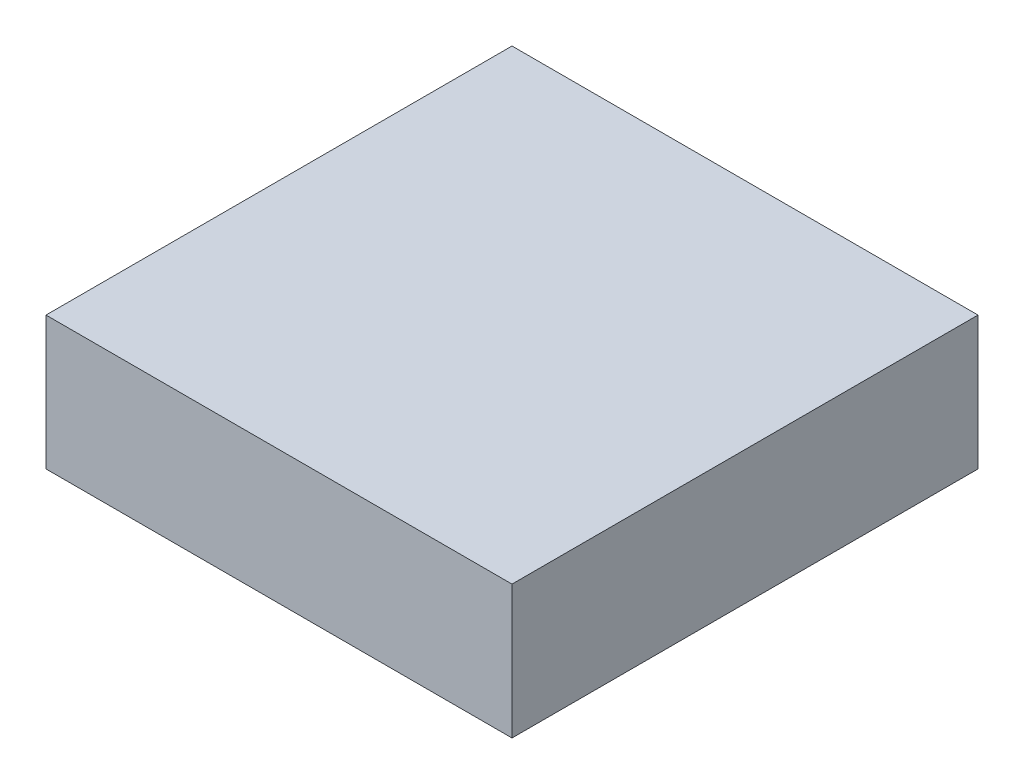
ISO-10303-21;
HEADER;
FILE_DESCRIPTION(('STEP AP214'),'2;1');
FILE_NAME('part.step','',(''),(''),'','','');
FILE_SCHEMA(('AUTOMOTIVE_DESIGN { 1 0 10303 214 1 1 1 1 }'));
ENDSEC;
DATA;
#1=APPLICATION_CONTEXT('core data for automotive mechanical design processes');
#2=APPLICATION_PROTOCOL_DEFINITION('international standard','automotive_design',2000,#1);
#3=PRODUCT_CONTEXT('',#1,'mechanical');
#4=PRODUCT('Part','Part','',(#3));
#5=PRODUCT_RELATED_PRODUCT_CATEGORY('part','',(#4));
#6=PRODUCT_DEFINITION_FORMATION('','',#4);
#7=PRODUCT_DEFINITION_CONTEXT('part definition',#1,'design');
#8=PRODUCT_DEFINITION('design','',#6,#7);
#9=PRODUCT_DEFINITION_SHAPE('','',#8);
#10=(LENGTH_UNIT() NAMED_UNIT(*) SI_UNIT(.MILLI.,.METRE.));
#11=(NAMED_UNIT(*) PLANE_ANGLE_UNIT() SI_UNIT($,.RADIAN.));
#12=(NAMED_UNIT(*) SI_UNIT($,.STERADIAN.) SOLID_ANGLE_UNIT());
#13=UNCERTAINTY_MEASURE_WITH_UNIT(LENGTH_MEASURE(1.E-05),#10,'distance_accuracy_value','');
#14=(GEOMETRIC_REPRESENTATION_CONTEXT(3) GLOBAL_UNCERTAINTY_ASSIGNED_CONTEXT((#13)) GLOBAL_UNIT_ASSIGNED_CONTEXT((#10,
#11,#12)) REPRESENTATION_CONTEXT('',''));
#15=CARTESIAN_POINT('',(0.,0.,0.));
#16=DIRECTION('',(0.,0.,1.));
#17=DIRECTION('',(1.,0.,0.));
#18=AXIS2_PLACEMENT_3D('',#15,#16,#17);
#19=CARTESIAN_POINT('',(311.055684786296,105.589280016504,7.34009304640806));
#20=DIRECTION('',(0.,0.,-1.));
#21=DIRECTION('',(-1.,0.,0.));
#22=AXIS2_PLACEMENT_3D('',#19,#20,#21);
#23=PLANE('',#22);
#24=DIRECTION('',(1.,0.,0.));
#25=VECTOR('',#24,1.);
#26=CARTESIAN_POINT('',(311.055684786296,90.5892800165043,7.34009304640806));
#27=LINE('',#26,#25);
#28=CARTESIAN_POINT('',(311.055684786296,90.5892800165043,7.34009304640806));
#29=VERTEX_POINT('',#28);
#30=CARTESIAN_POINT('',(363.498182619916,90.5892800165043,7.34009304640802));
#31=VERTEX_POINT('',#30);
#32=EDGE_CURVE('E79',#29,#31,#27,.T.);
#33=ORIENTED_EDGE('',*,*,#32,.F.);
#34=DIRECTION('',(0.,-1.,0.));
#35=VECTOR('',#34,1.);
#36=CARTESIAN_POINT('',(311.055684786296,105.589280016504,7.34009304640806));
#37=LINE('',#36,#35);
#38=CARTESIAN_POINT('',(311.055684786296,105.589280016504,7.34009304640806));
#39=VERTEX_POINT('',#38);
#40=EDGE_CURVE('E32',#39,#29,#37,.T.);
#41=ORIENTED_EDGE('',*,*,#40,.F.);
#42=DIRECTION('',(1.,0.,0.));
#43=VECTOR('',#42,1.);
#44=CARTESIAN_POINT('',(311.055684786296,105.589280016504,7.34009304640806));
#45=LINE('',#44,#43);
#46=CARTESIAN_POINT('',(363.498182619916,105.589280016504,7.34009304640802));
#47=VERTEX_POINT('',#46);
#48=EDGE_CURVE('E71',#39,#47,#45,.T.);
#49=ORIENTED_EDGE('',*,*,#48,.T.);
#50=DIRECTION('',(0.,-1.,0.));
#51=VECTOR('',#50,1.);
#52=CARTESIAN_POINT('',(363.498182619916,105.589280016504,7.34009304640802));
#53=LINE('',#52,#51);
#54=EDGE_CURVE('E10',#47,#31,#53,.T.);
#55=ORIENTED_EDGE('',*,*,#54,.T.);
#56=EDGE_LOOP('',(#33,#41,#49,#55));
#57=FACE_BOUND('',#56,.T.);
#58=ADVANCED_FACE('F16',(#57),#23,.T.);
#59=CARTESIAN_POINT('',(363.498182619916,105.589280016504,7.34009304640802));
#60=DIRECTION('',(1.,0.,0.));
#61=DIRECTION('',(0.,0.,-1.));
#62=AXIS2_PLACEMENT_3D('',#59,#60,#61);
#63=PLANE('',#62);
#64=DIRECTION('',(0.,0.,1.));
#65=VECTOR('',#64,1.);
#66=CARTESIAN_POINT('',(363.498182619916,90.5892800165043,7.34009304640802));
#67=LINE('',#66,#65);
#68=CARTESIAN_POINT('',(363.498182619916,90.5892800165043,59.7825908800286));
#69=VERTEX_POINT('',#68);
#70=EDGE_CURVE('E82',#31,#69,#67,.T.);
#71=ORIENTED_EDGE('',*,*,#70,.F.);
#72=ORIENTED_EDGE('',*,*,#54,.F.);
#73=DIRECTION('',(0.,0.,1.));
#74=VECTOR('',#73,1.);
#75=CARTESIAN_POINT('',(363.498182619916,105.589280016504,7.34009304640802));
#76=LINE('',#75,#74);
#77=CARTESIAN_POINT('',(363.498182619916,105.589280016504,59.7825908800286));
#78=VERTEX_POINT('',#77);
#79=EDGE_CURVE('E67',#47,#78,#76,.T.);
#80=ORIENTED_EDGE('',*,*,#79,.T.);
#81=DIRECTION('',(0.,-1.,0.));
#82=VECTOR('',#81,1.);
#83=CARTESIAN_POINT('',(363.498182619916,105.589280016504,59.7825908800286));
#84=LINE('',#83,#82);
#85=EDGE_CURVE('E24',#78,#69,#84,.T.);
#86=ORIENTED_EDGE('',*,*,#85,.T.);
#87=EDGE_LOOP('',(#71,#72,#80,#86));
#88=FACE_BOUND('',#87,.T.);
#89=ADVANCED_FACE('F68',(#88),#63,.T.);
#90=CARTESIAN_POINT('',(363.498182619916,105.589280016504,59.7825908800286));
#91=DIRECTION('',(0.,0.,1.));
#92=DIRECTION('',(1.,0.,0.));
#93=AXIS2_PLACEMENT_3D('',#90,#91,#92);
#94=PLANE('',#93);
#95=DIRECTION('',(-1.,0.,0.));
#96=VECTOR('',#95,1.);
#97=CARTESIAN_POINT('',(363.498182619916,90.5892800165043,59.7825908800286));
#98=LINE('',#97,#96);
#99=CARTESIAN_POINT('',(311.055684786296,90.5892800165043,59.7825908800286));
#100=VERTEX_POINT('',#99);
#101=EDGE_CURVE('E65',#69,#100,#98,.T.);
#102=ORIENTED_EDGE('',*,*,#101,.F.);
#103=ORIENTED_EDGE('',*,*,#85,.F.);
#104=DIRECTION('',(-1.,0.,0.));
#105=VECTOR('',#104,1.);
#106=CARTESIAN_POINT('',(363.498182619916,105.589280016504,59.7825908800286));
#107=LINE('',#106,#105);
#108=CARTESIAN_POINT('',(311.055684786296,105.589280016504,59.7825908800286));
#109=VERTEX_POINT('',#108);
#110=EDGE_CURVE('E62',#78,#109,#107,.T.);
#111=ORIENTED_EDGE('',*,*,#110,.T.);
#112=DIRECTION('',(0.,-1.,0.));
#113=VECTOR('',#112,1.);
#114=CARTESIAN_POINT('',(311.055684786296,105.589280016504,59.7825908800286));
#115=LINE('',#114,#113);
#116=EDGE_CURVE('E48',#109,#100,#115,.T.);
#117=ORIENTED_EDGE('',*,*,#116,.T.);
#118=EDGE_LOOP('',(#102,#103,#111,#117));
#119=FACE_BOUND('',#118,.T.);
#120=ADVANCED_FACE('F60',(#119),#94,.T.);
#121=CARTESIAN_POINT('',(311.055684786296,105.589280016504,59.7825908800286));
#122=DIRECTION('',(-1.,0.,0.));
#123=DIRECTION('',(0.,0.,1.));
#124=AXIS2_PLACEMENT_3D('',#121,#122,#123);
#125=PLANE('',#124);
#126=DIRECTION('',(0.,0.,-1.));
#127=VECTOR('',#126,1.);
#128=CARTESIAN_POINT('',(311.055684786296,90.5892800165043,59.7825908800286));
#129=LINE('',#128,#127);
#130=EDGE_CURVE('E85',#100,#29,#129,.T.);
#131=ORIENTED_EDGE('',*,*,#130,.F.);
#132=ORIENTED_EDGE('',*,*,#116,.F.);
#133=DIRECTION('',(0.,0.,-1.));
#134=VECTOR('',#133,1.);
#135=CARTESIAN_POINT('',(311.055684786296,105.589280016504,59.7825908800286));
#136=LINE('',#135,#134);
#137=EDGE_CURVE('E74',#109,#39,#136,.T.);
#138=ORIENTED_EDGE('',*,*,#137,.T.);
#139=ORIENTED_EDGE('',*,*,#40,.T.);
#140=EDGE_LOOP('',(#131,#132,#138,#139));
#141=FACE_BOUND('',#140,.T.);
#142=ADVANCED_FACE('F96',(#141),#125,.T.);
#143=CARTESIAN_POINT('',(311.776933703106,105.589280016504,33.5613419632183));
#144=DIRECTION('',(0.,-1.,0.));
#145=DIRECTION('',(1.,0.,0.));
#146=AXIS2_PLACEMENT_3D('',#143,#144,#145);
#147=PLANE('',#146);
#148=ORIENTED_EDGE('',*,*,#48,.F.);
#149=ORIENTED_EDGE('',*,*,#137,.F.);
#150=ORIENTED_EDGE('',*,*,#110,.F.);
#151=ORIENTED_EDGE('',*,*,#79,.F.);
#152=EDGE_LOOP('',(#148,#149,#150,#151));
#153=FACE_BOUND('',#152,.T.);
#154=ADVANCED_FACE('F73',(#153),#147,.F.);
#155=CARTESIAN_POINT('',(311.776933703106,90.5892800165043,33.5613419632183));
#156=DIRECTION('',(0.,-1.,0.));
#157=DIRECTION('',(1.,0.,0.));
#158=AXIS2_PLACEMENT_3D('',#155,#156,#157);
#159=PLANE('',#158);
#160=ORIENTED_EDGE('',*,*,#32,.T.);
#161=ORIENTED_EDGE('',*,*,#70,.T.);
#162=ORIENTED_EDGE('',*,*,#101,.T.);
#163=ORIENTED_EDGE('',*,*,#130,.T.);
#164=EDGE_LOOP('',(#160,#161,#162,#163));
#165=FACE_BOUND('',#164,.T.);
#166=ADVANCED_FACE('F89',(#165),#159,.T.);
#167=CLOSED_SHELL('',(#58,#89,#120,#142,#154,#166));
#168=MANIFOLD_SOLID_BREP('B1',#167);
#169=ADVANCED_BREP_SHAPE_REPRESENTATION('',(#18,#168),#14);
#170=SHAPE_DEFINITION_REPRESENTATION(#9,#169);
ENDSEC;
END-ISO-10303-21;
